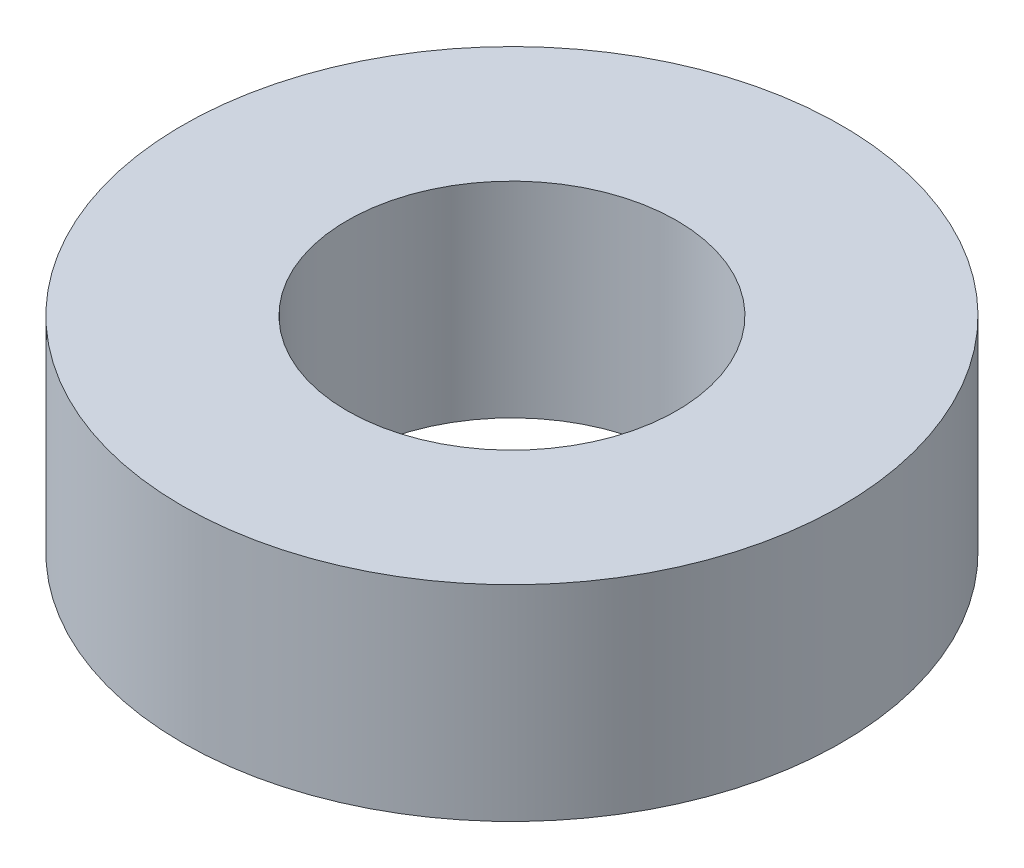
ISO-10303-21;
HEADER;
FILE_DESCRIPTION(('STEP AP214'),'2;1');
FILE_NAME('part.step','',(''),(''),'','','');
FILE_SCHEMA(('AUTOMOTIVE_DESIGN { 1 0 10303 214 1 1 1 1 }'));
ENDSEC;
DATA;
#1=APPLICATION_CONTEXT('core data for automotive mechanical design processes');
#2=APPLICATION_PROTOCOL_DEFINITION('international standard','automotive_design',2000,#1);
#3=PRODUCT_CONTEXT('',#1,'mechanical');
#4=PRODUCT('Part','Part','',(#3));
#5=PRODUCT_RELATED_PRODUCT_CATEGORY('part','',(#4));
#6=PRODUCT_DEFINITION_FORMATION('','',#4);
#7=PRODUCT_DEFINITION_CONTEXT('part definition',#1,'design');
#8=PRODUCT_DEFINITION('design','',#6,#7);
#9=PRODUCT_DEFINITION_SHAPE('','',#8);
#10=(LENGTH_UNIT() NAMED_UNIT(*) SI_UNIT(.MILLI.,.METRE.));
#11=(NAMED_UNIT(*) PLANE_ANGLE_UNIT() SI_UNIT($,.RADIAN.));
#12=(NAMED_UNIT(*) SI_UNIT($,.STERADIAN.) SOLID_ANGLE_UNIT());
#13=UNCERTAINTY_MEASURE_WITH_UNIT(LENGTH_MEASURE(1.E-05),#10,'distance_accuracy_value','');
#14=(GEOMETRIC_REPRESENTATION_CONTEXT(3) GLOBAL_UNCERTAINTY_ASSIGNED_CONTEXT((#13)) GLOBAL_UNIT_ASSIGNED_CONTEXT((#10,
#11,#12)) REPRESENTATION_CONTEXT('',''));
#15=CARTESIAN_POINT('',(0.,0.,0.));
#16=DIRECTION('',(0.,0.,1.));
#17=DIRECTION('',(1.,0.,0.));
#18=AXIS2_PLACEMENT_3D('',#15,#16,#17);
#19=CARTESIAN_POINT('',(0.,28.,0.));
#20=DIRECTION('',(0.,-1.,0.));
#21=DIRECTION('',(0.,0.,-1.));
#22=AXIS2_PLACEMENT_3D('',#19,#20,#21);
#23=CYLINDRICAL_SURFACE('',#22,45.);
#24=CARTESIAN_POINT('',(0.,28.,0.));
#25=DIRECTION('',(0.,1.,0.));
#26=DIRECTION('',(0.,0.,1.));
#27=AXIS2_PLACEMENT_3D('',#24,#25,#26);
#28=CIRCLE('',#27,45.);
#29=CARTESIAN_POINT('',(0.,28.,45.));
#30=VERTEX_POINT('',#29);
#31=EDGE_CURVE('E10',#30,#30,#28,.T.);
#32=ORIENTED_EDGE('',*,*,#31,.F.);
#33=EDGE_LOOP('',(#32));
#34=FACE_BOUND('',#33,.T.);
#35=CARTESIAN_POINT('',(0.,0.,0.));
#36=DIRECTION('',(0.,1.,0.));
#37=DIRECTION('',(0.,0.,1.));
#38=AXIS2_PLACEMENT_3D('',#35,#36,#37);
#39=CIRCLE('',#38,45.);
#40=CARTESIAN_POINT('',(0.,0.,45.));
#41=VERTEX_POINT('',#40);
#42=EDGE_CURVE('E37',#41,#41,#39,.T.);
#43=ORIENTED_EDGE('',*,*,#42,.T.);
#44=EDGE_LOOP('',(#43));
#45=FACE_BOUND('',#44,.T.);
#46=ADVANCED_FACE('F40',(#34,#45),#23,.T.);
#47=CARTESIAN_POINT('',(0.,28.,0.));
#48=DIRECTION('',(0.,1.,0.));
#49=DIRECTION('',(0.,0.,1.));
#50=AXIS2_PLACEMENT_3D('',#47,#48,#49);
#51=PLANE('',#50);
#52=CARTESIAN_POINT('',(0.,28.,0.));
#53=DIRECTION('',(0.,1.,0.));
#54=DIRECTION('',(0.,0.,1.));
#55=AXIS2_PLACEMENT_3D('',#52,#53,#54);
#56=CIRCLE('',#55,22.5);
#57=CARTESIAN_POINT('',(0.,28.,22.5));
#58=VERTEX_POINT('',#57);
#59=EDGE_CURVE('E50',#58,#58,#56,.T.);
#60=ORIENTED_EDGE('',*,*,#59,.F.);
#61=EDGE_LOOP('',(#60));
#62=FACE_BOUND('',#61,.T.);
#63=ORIENTED_EDGE('',*,*,#31,.T.);
#64=EDGE_LOOP('',(#63));
#65=FACE_BOUND('',#64,.T.);
#66=ADVANCED_FACE('F59',(#62,#65),#51,.T.);
#67=CARTESIAN_POINT('',(0.,0.,0.));
#68=DIRECTION('',(0.,1.,0.));
#69=DIRECTION('',(0.,0.,1.));
#70=AXIS2_PLACEMENT_3D('',#67,#68,#69);
#71=PLANE('',#70);
#72=CARTESIAN_POINT('',(0.,0.,0.));
#73=DIRECTION('',(0.,1.,0.));
#74=DIRECTION('',(0.,0.,1.));
#75=AXIS2_PLACEMENT_3D('',#72,#73,#74);
#76=CIRCLE('',#75,22.5);
#77=CARTESIAN_POINT('',(0.,0.,22.5));
#78=VERTEX_POINT('',#77);
#79=EDGE_CURVE('E47',#78,#78,#76,.T.);
#80=ORIENTED_EDGE('',*,*,#79,.T.);
#81=EDGE_LOOP('',(#80));
#82=FACE_BOUND('',#81,.T.);
#83=ORIENTED_EDGE('',*,*,#42,.F.);
#84=EDGE_LOOP('',(#83));
#85=FACE_BOUND('',#84,.T.);
#86=ADVANCED_FACE('F58',(#82,#85),#71,.F.);
#87=CARTESIAN_POINT('',(0.,28.,0.));
#88=DIRECTION('',(0.,-1.,0.));
#89=DIRECTION('',(0.,0.,-1.));
#90=AXIS2_PLACEMENT_3D('',#87,#88,#89);
#91=CYLINDRICAL_SURFACE('',#90,22.5);
#92=ORIENTED_EDGE('',*,*,#59,.T.);
#93=EDGE_LOOP('',(#92));
#94=FACE_BOUND('',#93,.T.);
#95=ORIENTED_EDGE('',*,*,#79,.F.);
#96=EDGE_LOOP('',(#95));
#97=FACE_BOUND('',#96,.T.);
#98=ADVANCED_FACE('F54',(#94,#97),#91,.F.);
#99=CLOSED_SHELL('',(#46,#66,#86,#98));
#100=MANIFOLD_SOLID_BREP('B2',#99);
#101=ADVANCED_BREP_SHAPE_REPRESENTATION('',(#18,#100),#14);
#102=SHAPE_DEFINITION_REPRESENTATION(#9,#101);
ENDSEC;
END-ISO-10303-21;
